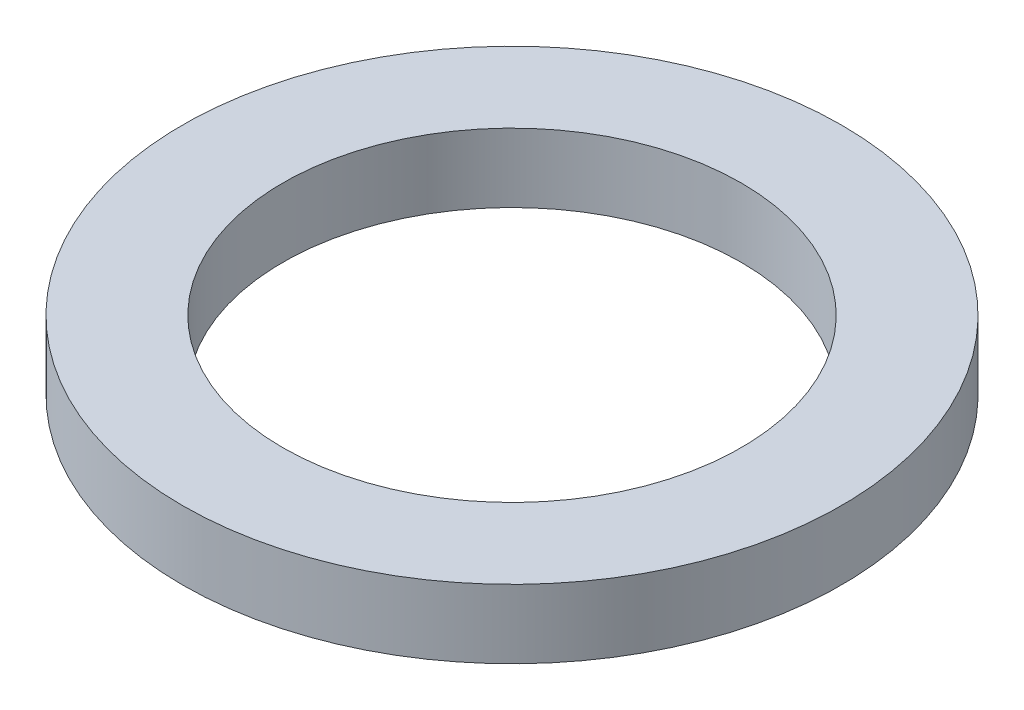
ISO-10303-21;
HEADER;
FILE_DESCRIPTION(('STEP AP214'),'2;1');
FILE_NAME('part.step','',(''),(''),'','','');
FILE_SCHEMA(('AUTOMOTIVE_DESIGN { 1 0 10303 214 1 1 1 1 }'));
ENDSEC;
DATA;
#1=APPLICATION_CONTEXT('core data for automotive mechanical design processes');
#2=APPLICATION_PROTOCOL_DEFINITION('international standard','automotive_design',2000,#1);
#3=PRODUCT_CONTEXT('',#1,'mechanical');
#4=PRODUCT('Part','Part','',(#3));
#5=PRODUCT_RELATED_PRODUCT_CATEGORY('part','',(#4));
#6=PRODUCT_DEFINITION_FORMATION('','',#4);
#7=PRODUCT_DEFINITION_CONTEXT('part definition',#1,'design');
#8=PRODUCT_DEFINITION('design','',#6,#7);
#9=PRODUCT_DEFINITION_SHAPE('','',#8);
#10=(LENGTH_UNIT() NAMED_UNIT(*) SI_UNIT(.MILLI.,.METRE.));
#11=(NAMED_UNIT(*) PLANE_ANGLE_UNIT() SI_UNIT($,.RADIAN.));
#12=(NAMED_UNIT(*) SI_UNIT($,.STERADIAN.) SOLID_ANGLE_UNIT());
#13=UNCERTAINTY_MEASURE_WITH_UNIT(LENGTH_MEASURE(1.E-05),#10,'distance_accuracy_value','');
#14=(GEOMETRIC_REPRESENTATION_CONTEXT(3) GLOBAL_UNCERTAINTY_ASSIGNED_CONTEXT((#13)) GLOBAL_UNIT_ASSIGNED_CONTEXT((#10,
#11,#12)) REPRESENTATION_CONTEXT('',''));
#15=CARTESIAN_POINT('',(0.,0.,0.));
#16=DIRECTION('',(0.,0.,1.));
#17=DIRECTION('',(1.,0.,0.));
#18=AXIS2_PLACEMENT_3D('',#15,#16,#17);
#19=CARTESIAN_POINT('',(0.,1.2,0.));
#20=DIRECTION('',(0.,1.,0.));
#21=DIRECTION('',(0.,0.,1.));
#22=AXIS2_PLACEMENT_3D('',#19,#20,#21);
#23=PLANE('',#22);
#24=CARTESIAN_POINT('',(0.,1.2,0.));
#25=DIRECTION('',(0.,1.,0.));
#26=DIRECTION('',(0.,0.,1.));
#27=AXIS2_PLACEMENT_3D('',#24,#25,#26);
#28=CIRCLE('',#27,5.75);
#29=CARTESIAN_POINT('',(0.,1.2,5.75));
#30=VERTEX_POINT('',#29);
#31=EDGE_CURVE('E10',#30,#30,#28,.T.);
#32=ORIENTED_EDGE('',*,*,#31,.T.);
#33=EDGE_LOOP('',(#32));
#34=FACE_BOUND('',#33,.T.);
#35=CARTESIAN_POINT('',(0.,1.2,0.));
#36=DIRECTION('',(0.,1.,0.));
#37=DIRECTION('',(0.,0.,1.));
#38=AXIS2_PLACEMENT_3D('',#35,#36,#37);
#39=CIRCLE('',#38,4.);
#40=CARTESIAN_POINT('',(0.,1.2,4.));
#41=VERTEX_POINT('',#40);
#42=EDGE_CURVE('E43',#41,#41,#39,.T.);
#43=ORIENTED_EDGE('',*,*,#42,.F.);
#44=EDGE_LOOP('',(#43));
#45=FACE_BOUND('',#44,.T.);
#46=ADVANCED_FACE('F32',(#34,#45),#23,.T.);
#47=CARTESIAN_POINT('',(0.,0.,0.));
#48=DIRECTION('',(0.,1.,0.));
#49=DIRECTION('',(0.,0.,1.));
#50=AXIS2_PLACEMENT_3D('',#47,#48,#49);
#51=PLANE('',#50);
#52=CARTESIAN_POINT('',(0.,0.,0.));
#53=DIRECTION('',(0.,1.,0.));
#54=DIRECTION('',(0.,0.,1.));
#55=AXIS2_PLACEMENT_3D('',#52,#53,#54);
#56=CIRCLE('',#55,5.75);
#57=CARTESIAN_POINT('',(0.,0.,5.75));
#58=VERTEX_POINT('',#57);
#59=EDGE_CURVE('E36',#58,#58,#56,.T.);
#60=ORIENTED_EDGE('',*,*,#59,.F.);
#61=EDGE_LOOP('',(#60));
#62=FACE_BOUND('',#61,.T.);
#63=CARTESIAN_POINT('',(0.,0.,0.));
#64=DIRECTION('',(0.,1.,0.));
#65=DIRECTION('',(0.,0.,1.));
#66=AXIS2_PLACEMENT_3D('',#63,#64,#65);
#67=CIRCLE('',#66,4.);
#68=CARTESIAN_POINT('',(0.,0.,4.));
#69=VERTEX_POINT('',#68);
#70=EDGE_CURVE('E45',#69,#69,#67,.T.);
#71=ORIENTED_EDGE('',*,*,#70,.T.);
#72=EDGE_LOOP('',(#71));
#73=FACE_BOUND('',#72,.T.);
#74=ADVANCED_FACE('F55',(#62,#73),#51,.F.);
#75=CARTESIAN_POINT('',(0.,1.2,0.));
#76=DIRECTION('',(0.,-1.,0.));
#77=DIRECTION('',(0.,0.,-1.));
#78=AXIS2_PLACEMENT_3D('',#75,#76,#77);
#79=CYLINDRICAL_SURFACE('',#78,5.75);
#80=ORIENTED_EDGE('',*,*,#31,.F.);
#81=EDGE_LOOP('',(#80));
#82=FACE_BOUND('',#81,.T.);
#83=ORIENTED_EDGE('',*,*,#59,.T.);
#84=EDGE_LOOP('',(#83));
#85=FACE_BOUND('',#84,.T.);
#86=ADVANCED_FACE('F34',(#82,#85),#79,.T.);
#87=CARTESIAN_POINT('',(0.,1.2,0.));
#88=DIRECTION('',(0.,-1.,0.));
#89=DIRECTION('',(0.,0.,-1.));
#90=AXIS2_PLACEMENT_3D('',#87,#88,#89);
#91=CYLINDRICAL_SURFACE('',#90,4.);
#92=ORIENTED_EDGE('',*,*,#42,.T.);
#93=EDGE_LOOP('',(#92));
#94=FACE_BOUND('',#93,.T.);
#95=ORIENTED_EDGE('',*,*,#70,.F.);
#96=EDGE_LOOP('',(#95));
#97=FACE_BOUND('',#96,.T.);
#98=ADVANCED_FACE('F51',(#94,#97),#91,.F.);
#99=CLOSED_SHELL('',(#46,#74,#86,#98));
#100=MANIFOLD_SOLID_BREP('B2',#99);
#101=ADVANCED_BREP_SHAPE_REPRESENTATION('',(#18,#100),#14);
#102=SHAPE_DEFINITION_REPRESENTATION(#9,#101);
ENDSEC;
END-ISO-10303-21;
